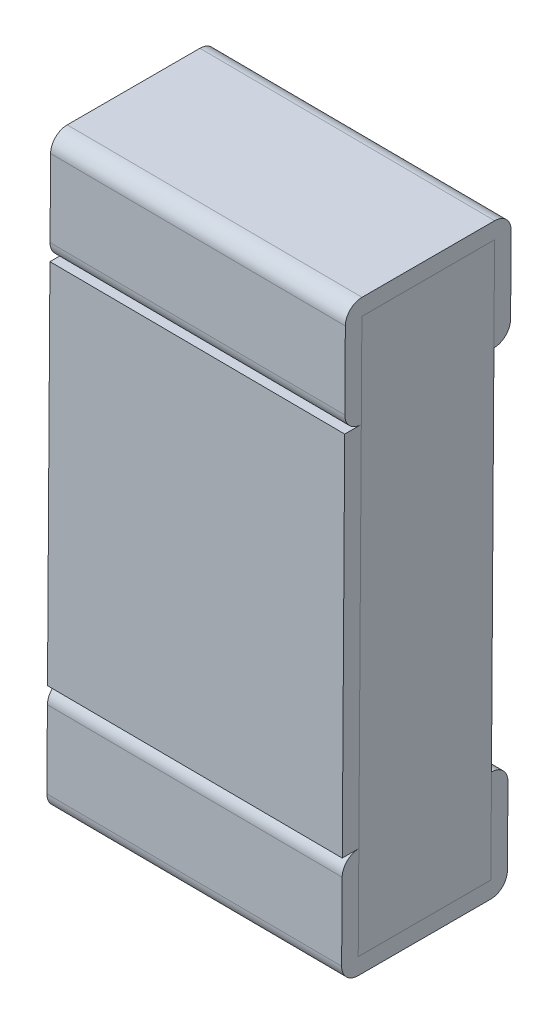
ISO-10303-21;
HEADER;
FILE_DESCRIPTION(('STEP AP214'),'2;1');
FILE_NAME('part.step','',(''),(''),'','','');
FILE_SCHEMA(('AUTOMOTIVE_DESIGN { 1 0 10303 214 1 1 1 1 }'));
ENDSEC;
DATA;
#1=APPLICATION_CONTEXT('core data for automotive mechanical design processes');
#2=APPLICATION_PROTOCOL_DEFINITION('international standard','automotive_design',2000,#1);
#3=PRODUCT_CONTEXT('',#1,'mechanical');
#4=PRODUCT('Part','Part','',(#3));
#5=PRODUCT_RELATED_PRODUCT_CATEGORY('part','',(#4));
#6=PRODUCT_DEFINITION_FORMATION('','',#4);
#7=PRODUCT_DEFINITION_CONTEXT('part definition',#1,'design');
#8=PRODUCT_DEFINITION('design','',#6,#7);
#9=PRODUCT_DEFINITION_SHAPE('','',#8);
#10=(LENGTH_UNIT() NAMED_UNIT(*) SI_UNIT(.MILLI.,.METRE.));
#11=(NAMED_UNIT(*) PLANE_ANGLE_UNIT() SI_UNIT($,.RADIAN.));
#12=(NAMED_UNIT(*) SI_UNIT($,.STERADIAN.) SOLID_ANGLE_UNIT());
#13=UNCERTAINTY_MEASURE_WITH_UNIT(LENGTH_MEASURE(1.E-05),#10,'distance_accuracy_value','');
#14=(GEOMETRIC_REPRESENTATION_CONTEXT(3) GLOBAL_UNCERTAINTY_ASSIGNED_CONTEXT((#13)) GLOBAL_UNIT_ASSIGNED_CONTEXT((#10,
#11,#12)) REPRESENTATION_CONTEXT('',''));
#15=CARTESIAN_POINT('',(0.,0.,0.));
#16=DIRECTION('',(0.,0.,1.));
#17=DIRECTION('',(1.,0.,0.));
#18=AXIS2_PLACEMENT_3D('',#15,#16,#17);
#19=CARTESIAN_POINT('',(187.546385875029,105.575053964965,142.661582908599));
#20=DIRECTION('',(0.,0.,1.));
#21=DIRECTION('',(1.,0.,0.));
#22=AXIS2_PLACEMENT_3D('',#19,#20,#21);
#23=PLANE('',#22);
#24=DIRECTION('',(-0.999978016708569,0.00663069374923689,0.));
#25=VECTOR('',#24,1.);
#26=CARTESIAN_POINT('',(187.546385875029,105.575053964965,142.661582908599));
#27=LINE('',#26,#25);
#28=CARTESIAN_POINT('',(187.546385875029,105.575053964965,142.661582908599));
#29=VERTEX_POINT('',#28);
#30=CARTESIAN_POINT('',(186.746403461662,105.580358519964,142.661582908599));
#31=VERTEX_POINT('',#30);
#32=EDGE_CURVE('E66',#29,#31,#27,.T.);
#33=ORIENTED_EDGE('',*,*,#32,.F.);
#34=DIRECTION('',(0.00663069374923689,0.999978016708569,0.));
#35=VECTOR('',#34,1.);
#36=CARTESIAN_POINT('',(187.546385875029,105.575053964965,142.661582908599));
#37=LINE('',#36,#35);
#38=CARTESIAN_POINT('',(187.553016568778,106.575031981673,142.661582908599));
#39=VERTEX_POINT('',#38);
#40=EDGE_CURVE('E11',#29,#39,#37,.T.);
#41=ORIENTED_EDGE('',*,*,#40,.T.);
#42=DIRECTION('',(-0.999978016708569,0.00663069374923689,0.));
#43=VECTOR('',#42,1.);
#44=CARTESIAN_POINT('',(187.553016568778,106.575031981673,142.661582908599));
#45=LINE('',#44,#43);
#46=CARTESIAN_POINT('',(186.753034155411,106.580336536673,142.661582908599));
#47=VERTEX_POINT('',#46);
#48=EDGE_CURVE('E48',#39,#47,#45,.T.);
#49=ORIENTED_EDGE('',*,*,#48,.T.);
#50=DIRECTION('',(0.00663069374923689,0.999978016708569,0.));
#51=VECTOR('',#50,1.);
#52=CARTESIAN_POINT('',(186.746403461662,105.580358519964,142.661582908599));
#53=LINE('',#52,#51);
#54=EDGE_CURVE('E253',#31,#47,#53,.T.);
#55=ORIENTED_EDGE('',*,*,#54,.F.);
#56=EDGE_LOOP('',(#33,#41,#49,#55));
#57=FACE_BOUND('',#56,.T.);
#58=ADVANCED_FACE('F44',(#57),#23,.T.);
#59=CARTESIAN_POINT('',(187.553016568778,106.575031981673,142.616582908599));
#60=DIRECTION('',(0.00663069374923689,0.99997801670857,0.));
#61=DIRECTION('',(0.,0.,-1.));
#62=AXIS2_PLACEMENT_3D('',#59,#60,#61);
#63=PLANE('',#62);
#64=DIRECTION('',(0.,0.,1.));
#65=VECTOR('',#64,1.);
#66=CARTESIAN_POINT('',(187.553016568778,106.575031981673,142.616582908599));
#67=LINE('',#66,#65);
#68=CARTESIAN_POINT('',(187.553016568778,106.575031981673,142.616582908599));
#69=VERTEX_POINT('',#68);
#70=EDGE_CURVE('E263',#69,#39,#67,.T.);
#71=ORIENTED_EDGE('',*,*,#70,.F.);
#72=DIRECTION('',(-0.999978016708569,0.00663069374923689,0.));
#73=VECTOR('',#72,1.);
#74=CARTESIAN_POINT('',(187.553016568778,106.575031981673,142.616582908599));
#75=LINE('',#74,#73);
#76=CARTESIAN_POINT('',(186.753034155411,106.580336536673,142.616582908599));
#77=VERTEX_POINT('',#76);
#78=EDGE_CURVE('E380',#69,#77,#75,.T.);
#79=ORIENTED_EDGE('',*,*,#78,.T.);
#80=DIRECTION('',(0.,0.,1.));
#81=VECTOR('',#80,1.);
#82=CARTESIAN_POINT('',(186.753034155411,106.580336536673,142.616582908599));
#83=LINE('',#82,#81);
#84=EDGE_CURVE('E361',#77,#47,#83,.T.);
#85=ORIENTED_EDGE('',*,*,#84,.T.);
#86=ORIENTED_EDGE('',*,*,#48,.F.);
#87=EDGE_LOOP('',(#71,#79,#85,#86));
#88=FACE_BOUND('',#87,.T.);
#89=ADVANCED_FACE('F482',(#88),#63,.T.);
#90=CARTESIAN_POINT('',(187.553314949996,106.620030992425,142.616582908599));
#91=DIRECTION('',(-0.999978016708571,0.00663069374900344,0.));
#92=DIRECTION('',(-0.00663069374900344,-0.999978016708571,0.));
#93=AXIS2_PLACEMENT_3D('',#90,#91,#92);
#94=CYLINDRICAL_SURFACE('',#93,0.0450000000000037);
#95=CARTESIAN_POINT('',(187.553314949996,106.620030992425,142.616582908599));
#96=DIRECTION('',(-0.99997801670857,0.00663069374923689,0.));
#97=DIRECTION('',(0.,0.,1.));
#98=AXIS2_PLACEMENT_3D('',#95,#96,#97);
#99=CIRCLE('',#98,0.0449999999999895);
#100=CARTESIAN_POINT('',(187.553314949996,106.620030992425,142.661582908599));
#101=VERTEX_POINT('',#100);
#102=EDGE_CURVE('E357',#69,#101,#99,.T.);
#103=ORIENTED_EDGE('',*,*,#102,.T.);
#104=DIRECTION('',(-0.999978016708569,0.00663069374923689,0.));
#105=VECTOR('',#104,1.);
#106=CARTESIAN_POINT('',(187.553314949996,106.620030992425,142.661582908599));
#107=LINE('',#106,#105);
#108=CARTESIAN_POINT('',(186.75333253663,106.625335547425,142.661582908599));
#109=VERTEX_POINT('',#108);
#110=EDGE_CURVE('E362',#101,#109,#107,.T.);
#111=ORIENTED_EDGE('',*,*,#110,.T.);
#112=CARTESIAN_POINT('',(186.75333253663,106.625335547425,142.616582908599));
#113=DIRECTION('',(-0.99997801670857,0.00663069374923689,0.));
#114=DIRECTION('',(0.,0.,1.));
#115=AXIS2_PLACEMENT_3D('',#112,#113,#114);
#116=CIRCLE('',#115,0.0449999999999895);
#117=EDGE_CURVE('E257',#77,#109,#116,.T.);
#118=ORIENTED_EDGE('',*,*,#117,.F.);
#119=ORIENTED_EDGE('',*,*,#78,.F.);
#120=EDGE_LOOP('',(#103,#111,#118,#119));
#121=FACE_BOUND('',#120,.T.);
#122=ADVANCED_FACE('F565',(#121),#94,.T.);
#123=CARTESIAN_POINT('',(187.553016568778,106.575031981673,142.661582908599));
#124=DIRECTION('',(0.,0.,1.));
#125=DIRECTION('',(1.,0.,0.));
#126=AXIS2_PLACEMENT_3D('',#123,#124,#125);
#127=PLANE('',#126);
#128=DIRECTION('',(0.00663069374923689,0.999978016708569,0.));
#129=VECTOR('',#128,1.);
#130=CARTESIAN_POINT('',(186.753034155411,106.580336536673,142.661582908599));
#131=LINE('',#130,#129);
#132=CARTESIAN_POINT('',(186.754724982317,106.835330930934,142.661582908599));
#133=VERTEX_POINT('',#132);
#134=EDGE_CURVE('E308',#109,#133,#131,.T.);
#135=ORIENTED_EDGE('',*,*,#134,.F.);
#136=ORIENTED_EDGE('',*,*,#110,.F.);
#137=DIRECTION('',(0.00663069374923689,0.999978016708569,0.));
#138=VECTOR('',#137,1.);
#139=CARTESIAN_POINT('',(187.553016568778,106.575031981673,142.661582908599));
#140=LINE('',#139,#138);
#141=CARTESIAN_POINT('',(187.554707395684,106.830026375934,142.661582908599));
#142=VERTEX_POINT('',#141);
#143=EDGE_CURVE('E414',#101,#142,#140,.T.);
#144=ORIENTED_EDGE('',*,*,#143,.T.);
#145=DIRECTION('',(-0.999978016708569,0.00663069374923689,0.));
#146=VECTOR('',#145,1.);
#147=CARTESIAN_POINT('',(187.554707395684,106.830026375934,142.661582908599));
#148=LINE('',#147,#146);
#149=EDGE_CURVE('E315',#142,#133,#148,.T.);
#150=ORIENTED_EDGE('',*,*,#149,.T.);
#151=EDGE_LOOP('',(#135,#136,#144,#150));
#152=FACE_BOUND('',#151,.T.);
#153=ADVANCED_FACE('F584',(#152),#127,.T.);
#154=CARTESIAN_POINT('',(187.554707395684,106.830026375934,142.616582908599));
#155=DIRECTION('',(-0.999978016708571,0.00663069374900344,0.));
#156=DIRECTION('',(0.00663069374900344,0.999978016708571,0.));
#157=AXIS2_PLACEMENT_3D('',#154,#155,#156);
#158=CYLINDRICAL_SURFACE('',#157,0.0450000000000037);
#159=DIRECTION('',(-0.999978016708569,0.00663069374923689,0.));
#160=VECTOR('',#159,1.);
#161=CARTESIAN_POINT('',(187.555005776903,106.875025386686,142.616582908599));
#162=LINE('',#161,#160);
#163=CARTESIAN_POINT('',(187.555005776903,106.875025386686,142.616582908599));
#164=VERTEX_POINT('',#163);
#165=CARTESIAN_POINT('',(186.755023363535,106.880329941685,142.616582908599));
#166=VERTEX_POINT('',#165);
#167=EDGE_CURVE('E311',#164,#166,#162,.T.);
#168=ORIENTED_EDGE('',*,*,#167,.T.);
#169=CARTESIAN_POINT('',(186.754724982317,106.835330930934,142.616582908599));
#170=DIRECTION('',(0.99997801670857,-0.00663069374923689,0.));
#171=DIRECTION('',(0.,0.,1.));
#172=AXIS2_PLACEMENT_3D('',#169,#170,#171);
#173=CIRCLE('',#172,0.0449999999999895);
#174=EDGE_CURVE('E316',#166,#133,#173,.T.);
#175=ORIENTED_EDGE('',*,*,#174,.T.);
#176=ORIENTED_EDGE('',*,*,#149,.F.);
#177=CARTESIAN_POINT('',(187.554707395684,106.830026375934,142.616582908599));
#178=DIRECTION('',(0.99997801670857,-0.00663069374923689,0.));
#179=DIRECTION('',(0.,0.,1.));
#180=AXIS2_PLACEMENT_3D('',#177,#178,#179);
#181=CIRCLE('',#180,0.0449999999999895);
#182=EDGE_CURVE('E345',#164,#142,#181,.T.);
#183=ORIENTED_EDGE('',*,*,#182,.F.);
#184=EDGE_LOOP('',(#168,#175,#176,#183));
#185=FACE_BOUND('',#184,.T.);
#186=ADVANCED_FACE('F580',(#185),#158,.T.);
#187=CARTESIAN_POINT('',(187.555005776903,106.875025386686,142.211582908599));
#188=DIRECTION('',(0.00663069374923689,0.99997801670857,0.));
#189=DIRECTION('',(0.,0.,-1.));
#190=AXIS2_PLACEMENT_3D('',#187,#188,#189);
#191=PLANE('',#190);
#192=DIRECTION('',(0.,0.,1.));
#193=VECTOR('',#192,1.);
#194=CARTESIAN_POINT('',(187.555005776903,106.875025386686,142.211582908599));
#195=LINE('',#194,#193);
#196=CARTESIAN_POINT('',(187.555005776903,106.875025386686,142.256582908599));
#197=VERTEX_POINT('',#196);
#198=EDGE_CURVE('E384',#197,#164,#195,.T.);
#199=ORIENTED_EDGE('',*,*,#198,.F.);
#200=DIRECTION('',(-0.999978016708569,0.00663069374923689,0.));
#201=VECTOR('',#200,1.);
#202=CARTESIAN_POINT('',(187.555005776903,106.875025386686,142.256582908599));
#203=LINE('',#202,#201);
#204=CARTESIAN_POINT('',(186.755023363535,106.880329941685,142.256582908599));
#205=VERTEX_POINT('',#204);
#206=EDGE_CURVE('E299',#197,#205,#203,.T.);
#207=ORIENTED_EDGE('',*,*,#206,.T.);
#208=DIRECTION('',(0.,0.,1.));
#209=VECTOR('',#208,1.);
#210=CARTESIAN_POINT('',(186.755023363535,106.880329941685,142.211582908599));
#211=LINE('',#210,#209);
#212=EDGE_CURVE('E295',#205,#166,#211,.T.);
#213=ORIENTED_EDGE('',*,*,#212,.T.);
#214=ORIENTED_EDGE('',*,*,#167,.F.);
#215=EDGE_LOOP('',(#199,#207,#213,#214));
#216=FACE_BOUND('',#215,.T.);
#217=ADVANCED_FACE('F583',(#216),#191,.T.);
#218=CARTESIAN_POINT('',(187.554707395684,106.830026375934,142.256582908599));
#219=DIRECTION('',(-0.999978016708571,0.00663069374900344,0.));
#220=DIRECTION('',(0.00663069374900344,0.999978016708571,0.));
#221=AXIS2_PLACEMENT_3D('',#218,#219,#220);
#222=CYLINDRICAL_SURFACE('',#221,0.0450000000000037);
#223=CARTESIAN_POINT('',(187.554707395684,106.830026375934,142.256582908599));
#224=DIRECTION('',(-0.99997801670857,0.00663069374923689,0.));
#225=DIRECTION('',(0.,0.,1.));
#226=AXIS2_PLACEMENT_3D('',#223,#224,#225);
#227=CIRCLE('',#226,0.0449999999999895);
#228=CARTESIAN_POINT('',(187.554707395684,106.830026375934,142.211582908599));
#229=VERTEX_POINT('',#228);
#230=EDGE_CURVE('E300',#197,#229,#227,.T.);
#231=ORIENTED_EDGE('',*,*,#230,.T.);
#232=DIRECTION('',(-0.999978016708569,0.00663069374923689,0.));
#233=VECTOR('',#232,1.);
#234=CARTESIAN_POINT('',(187.554707395684,106.830026375934,142.211582908599));
#235=LINE('',#234,#233);
#236=CARTESIAN_POINT('',(186.754724982317,106.835330930934,142.211582908599));
#237=VERTEX_POINT('',#236);
#238=EDGE_CURVE('E238',#229,#237,#235,.T.);
#239=ORIENTED_EDGE('',*,*,#238,.T.);
#240=CARTESIAN_POINT('',(186.754724982317,106.835330930934,142.256582908599));
#241=DIRECTION('',(-0.99997801670857,0.00663069374923689,0.));
#242=DIRECTION('',(0.,0.,1.));
#243=AXIS2_PLACEMENT_3D('',#240,#241,#242);
#244=CIRCLE('',#243,0.0449999999999895);
#245=EDGE_CURVE('E223',#205,#237,#244,.T.);
#246=ORIENTED_EDGE('',*,*,#245,.F.);
#247=ORIENTED_EDGE('',*,*,#206,.F.);
#248=EDGE_LOOP('',(#231,#239,#246,#247));
#249=FACE_BOUND('',#248,.T.);
#250=ADVANCED_FACE('F586',(#249),#222,.T.);
#251=CARTESIAN_POINT('',(187.553016568778,106.575031981673,142.211582908599));
#252=DIRECTION('',(0.,0.,1.));
#253=DIRECTION('',(1.,0.,0.));
#254=AXIS2_PLACEMENT_3D('',#251,#252,#253);
#255=PLANE('',#254);
#256=ORIENTED_EDGE('',*,*,#238,.F.);
#257=DIRECTION('',(0.00663069374923689,0.999978016708569,0.));
#258=VECTOR('',#257,1.);
#259=CARTESIAN_POINT('',(187.553016568778,106.575031981673,142.211582908599));
#260=LINE('',#259,#258);
#261=CARTESIAN_POINT('',(187.553314949996,106.620030992425,142.211582908599));
#262=VERTEX_POINT('',#261);
#263=EDGE_CURVE('E233',#262,#229,#260,.T.);
#264=ORIENTED_EDGE('',*,*,#263,.F.);
#265=DIRECTION('',(-0.999978016708569,0.00663069374923689,0.));
#266=VECTOR('',#265,1.);
#267=CARTESIAN_POINT('',(187.553314949996,106.620030992425,142.211582908599));
#268=LINE('',#267,#266);
#269=CARTESIAN_POINT('',(186.75333253663,106.625335547425,142.211582908599));
#270=VERTEX_POINT('',#269);
#271=EDGE_CURVE('E227',#262,#270,#268,.T.);
#272=ORIENTED_EDGE('',*,*,#271,.T.);
#273=DIRECTION('',(0.00663069374923689,0.999978016708569,0.));
#274=VECTOR('',#273,1.);
#275=CARTESIAN_POINT('',(186.753034155411,106.580336536673,142.211582908599));
#276=LINE('',#275,#274);
#277=EDGE_CURVE('E216',#270,#237,#276,.T.);
#278=ORIENTED_EDGE('',*,*,#277,.T.);
#279=EDGE_LOOP('',(#256,#264,#272,#278));
#280=FACE_BOUND('',#279,.T.);
#281=ADVANCED_FACE('F231',(#280),#255,.F.);
#282=CARTESIAN_POINT('',(187.553314949996,106.620030992425,142.256582908599));
#283=DIRECTION('',(-0.999978016708571,0.00663069374900344,0.));
#284=DIRECTION('',(-0.00663069374900344,-0.999978016708571,0.));
#285=AXIS2_PLACEMENT_3D('',#282,#283,#284);
#286=CYLINDRICAL_SURFACE('',#285,0.0450000000000037);
#287=DIRECTION('',(-0.999978016708569,0.00663069374923689,0.));
#288=VECTOR('',#287,1.);
#289=CARTESIAN_POINT('',(187.553016568778,106.575031981673,142.256582908599));
#290=LINE('',#289,#288);
#291=CARTESIAN_POINT('',(187.553016568778,106.575031981673,142.256582908599));
#292=VERTEX_POINT('',#291);
#293=CARTESIAN_POINT('',(186.753034155411,106.580336536673,142.256582908599));
#294=VERTEX_POINT('',#293);
#295=EDGE_CURVE('E228',#292,#294,#290,.T.);
#296=ORIENTED_EDGE('',*,*,#295,.T.);
#297=CARTESIAN_POINT('',(186.75333253663,106.625335547425,142.256582908599));
#298=DIRECTION('',(0.99997801670857,-0.00663069374923689,0.));
#299=DIRECTION('',(0.,0.,1.));
#300=AXIS2_PLACEMENT_3D('',#297,#298,#299);
#301=CIRCLE('',#300,0.0449999999999895);
#302=EDGE_CURVE('E220',#294,#270,#301,.T.);
#303=ORIENTED_EDGE('',*,*,#302,.T.);
#304=ORIENTED_EDGE('',*,*,#271,.F.);
#305=CARTESIAN_POINT('',(187.553314949996,106.620030992425,142.256582908599));
#306=DIRECTION('',(0.99997801670857,-0.00663069374923689,0.));
#307=DIRECTION('',(0.,0.,1.));
#308=AXIS2_PLACEMENT_3D('',#305,#306,#307);
#309=CIRCLE('',#308,0.0449999999999895);
#310=EDGE_CURVE('E346',#292,#262,#309,.T.);
#311=ORIENTED_EDGE('',*,*,#310,.F.);
#312=EDGE_LOOP('',(#296,#303,#304,#311));
#313=FACE_BOUND('',#312,.T.);
#314=ADVANCED_FACE('F240',(#313),#286,.T.);
#315=CARTESIAN_POINT('',(186.746403461662,105.580358519964,142.616582908599));
#316=DIRECTION('',(-0.99997801670857,0.00663069374923689,0.));
#317=DIRECTION('',(0.,0.,1.));
#318=AXIS2_PLACEMENT_3D('',#315,#316,#317);
#319=PLANE('',#318);
#320=DIRECTION('',(0.00663069374923689,0.999978016708569,0.));
#321=VECTOR('',#320,1.);
#322=CARTESIAN_POINT('',(186.746403461662,105.580358519964,142.616582908599));
#323=LINE('',#322,#321);
#324=CARTESIAN_POINT('',(186.746403461662,105.580358519964,142.616582908599));
#325=VERTEX_POINT('',#324);
#326=EDGE_CURVE('E388',#325,#77,#323,.T.);
#327=ORIENTED_EDGE('',*,*,#326,.F.);
#328=DIRECTION('',(0.,0.,1.));
#329=VECTOR('',#328,1.);
#330=CARTESIAN_POINT('',(186.746403461662,105.580358519964,142.616582908599));
#331=LINE('',#330,#329);
#332=EDGE_CURVE('E244',#325,#31,#331,.T.);
#333=ORIENTED_EDGE('',*,*,#332,.T.);
#334=ORIENTED_EDGE('',*,*,#54,.T.);
#335=ORIENTED_EDGE('',*,*,#84,.F.);
#336=EDGE_LOOP('',(#327,#333,#334,#335));
#337=FACE_BOUND('',#336,.T.);
#338=ADVANCED_FACE('F485',(#337),#319,.T.);
#339=CARTESIAN_POINT('',(186.753034155411,106.580336536673,142.211582908599));
#340=DIRECTION('',(-0.99997801670857,0.00663069374923689,0.));
#341=DIRECTION('',(0.,0.,1.));
#342=AXIS2_PLACEMENT_3D('',#339,#340,#341);
#343=PLANE('',#342);
#344=ORIENTED_EDGE('',*,*,#277,.F.);
#345=ORIENTED_EDGE('',*,*,#302,.F.);
#346=DIRECTION('',(0.00663069374923689,0.999978016708569,0.));
#347=VECTOR('',#346,1.);
#348=CARTESIAN_POINT('',(186.744712634756,105.325364125704,142.256582908599));
#349=LINE('',#348,#347);
#350=CARTESIAN_POINT('',(186.754724982317,106.835330930934,142.256582908599));
#351=VERTEX_POINT('',#350);
#352=EDGE_CURVE('E363',#294,#351,#349,.T.);
#353=ORIENTED_EDGE('',*,*,#352,.T.);
#354=DIRECTION('',(0.,0.,1.));
#355=VECTOR('',#354,1.);
#356=CARTESIAN_POINT('',(186.754724982317,106.835330930934,142.256582908599));
#357=LINE('',#356,#355);
#358=CARTESIAN_POINT('',(186.754724982317,106.835330930934,142.616582908599));
#359=VERTEX_POINT('',#358);
#360=EDGE_CURVE('E366',#351,#359,#357,.T.);
#361=ORIENTED_EDGE('',*,*,#360,.T.);
#362=DIRECTION('',(0.00663069374923689,0.999978016708569,0.));
#363=VECTOR('',#362,1.);
#364=CARTESIAN_POINT('',(186.744712634756,105.325364125704,142.616582908599));
#365=LINE('',#364,#363);
#366=EDGE_CURVE('E294',#77,#359,#365,.T.);
#367=ORIENTED_EDGE('',*,*,#366,.F.);
#368=ORIENTED_EDGE('',*,*,#117,.T.);
#369=ORIENTED_EDGE('',*,*,#134,.T.);
#370=ORIENTED_EDGE('',*,*,#174,.F.);
#371=ORIENTED_EDGE('',*,*,#212,.F.);
#372=ORIENTED_EDGE('',*,*,#245,.T.);
#373=EDGE_LOOP('',(#344,#345,#353,#361,#367,#368,#369,#370,#371,#372));
#374=FACE_BOUND('',#373,.T.);
#375=ADVANCED_FACE('F218',(#374),#343,.T.);
#376=CARTESIAN_POINT('',(187.546385875029,105.575053964965,142.616582908599));
#377=DIRECTION('',(0.00663069374923689,0.99997801670857,0.));
#378=DIRECTION('',(0.,0.,-1.));
#379=AXIS2_PLACEMENT_3D('',#376,#377,#378);
#380=PLANE('',#379);
#381=ORIENTED_EDGE('',*,*,#32,.T.);
#382=ORIENTED_EDGE('',*,*,#332,.F.);
#383=DIRECTION('',(-0.999978016708569,0.00663069374923689,0.));
#384=VECTOR('',#383,1.);
#385=CARTESIAN_POINT('',(187.546385875029,105.575053964965,142.616582908599));
#386=LINE('',#385,#384);
#387=CARTESIAN_POINT('',(187.546385875029,105.575053964965,142.616582908599));
#388=VERTEX_POINT('',#387);
#389=EDGE_CURVE('E291',#388,#325,#386,.T.);
#390=ORIENTED_EDGE('',*,*,#389,.F.);
#391=DIRECTION('',(0.,0.,1.));
#392=VECTOR('',#391,1.);
#393=CARTESIAN_POINT('',(187.546385875029,105.575053964965,142.616582908599));
#394=LINE('',#393,#392);
#395=EDGE_CURVE('E266',#388,#29,#394,.T.);
#396=ORIENTED_EDGE('',*,*,#395,.T.);
#397=EDGE_LOOP('',(#381,#382,#390,#396));
#398=FACE_BOUND('',#397,.T.);
#399=ADVANCED_FACE('F490',(#398),#380,.F.);
#400=CARTESIAN_POINT('',(187.546385875029,105.575053964965,142.616582908599));
#401=DIRECTION('',(-0.99997801670857,0.00663069374923689,0.));
#402=DIRECTION('',(0.,0.,1.));
#403=AXIS2_PLACEMENT_3D('',#400,#401,#402);
#404=PLANE('',#403);
#405=ORIENTED_EDGE('',*,*,#70,.T.);
#406=ORIENTED_EDGE('',*,*,#40,.F.);
#407=ORIENTED_EDGE('',*,*,#395,.F.);
#408=DIRECTION('',(0.00663069374923689,0.999978016708569,0.));
#409=VECTOR('',#408,1.);
#410=CARTESIAN_POINT('',(187.546385875029,105.575053964965,142.616582908599));
#411=LINE('',#410,#409);
#412=EDGE_CURVE('E267',#388,#69,#411,.T.);
#413=ORIENTED_EDGE('',*,*,#412,.T.);
#414=EDGE_LOOP('',(#405,#406,#407,#413));
#415=FACE_BOUND('',#414,.T.);
#416=ADVANCED_FACE('F575',(#415),#404,.F.);
#417=CARTESIAN_POINT('',(187.553016568778,106.575031981673,142.211582908599));
#418=DIRECTION('',(-0.99997801670857,0.00663069374923689,0.));
#419=DIRECTION('',(0.,0.,1.));
#420=AXIS2_PLACEMENT_3D('',#417,#418,#419);
#421=PLANE('',#420);
#422=ORIENTED_EDGE('',*,*,#230,.F.);
#423=ORIENTED_EDGE('',*,*,#198,.T.);
#424=ORIENTED_EDGE('',*,*,#182,.T.);
#425=ORIENTED_EDGE('',*,*,#143,.F.);
#426=ORIENTED_EDGE('',*,*,#102,.F.);
#427=DIRECTION('',(0.00663069374923689,0.999978016708569,0.));
#428=VECTOR('',#427,1.);
#429=CARTESIAN_POINT('',(187.544695048123,105.320059570704,142.616582908599));
#430=LINE('',#429,#428);
#431=CARTESIAN_POINT('',(187.554707395684,106.830026375934,142.616582908599));
#432=VERTEX_POINT('',#431);
#433=EDGE_CURVE('E342',#69,#432,#430,.T.);
#434=ORIENTED_EDGE('',*,*,#433,.T.);
#435=DIRECTION('',(0.,0.,1.));
#436=VECTOR('',#435,1.);
#437=CARTESIAN_POINT('',(187.554707395684,106.830026375934,142.256582908599));
#438=LINE('',#437,#436);
#439=CARTESIAN_POINT('',(187.554707395684,106.830026375934,142.256582908599));
#440=VERTEX_POINT('',#439);
#441=EDGE_CURVE('E391',#440,#432,#438,.T.);
#442=ORIENTED_EDGE('',*,*,#441,.F.);
#443=DIRECTION('',(0.00663069374923689,0.999978016708569,0.));
#444=VECTOR('',#443,1.);
#445=CARTESIAN_POINT('',(187.544695048123,105.320059570704,142.256582908599));
#446=LINE('',#445,#444);
#447=EDGE_CURVE('E395',#292,#440,#446,.T.);
#448=ORIENTED_EDGE('',*,*,#447,.F.);
#449=ORIENTED_EDGE('',*,*,#310,.T.);
#450=ORIENTED_EDGE('',*,*,#263,.T.);
#451=EDGE_LOOP('',(#422,#423,#424,#425,#426,#434,#442,#448,#449,#450));
#452=FACE_BOUND('',#451,.T.);
#453=ADVANCED_FACE('F578',(#452),#421,.F.);
#454=CARTESIAN_POINT('',(187.544695048123,105.320059570704,142.256582908599));
#455=DIRECTION('',(0.,0.,1.));
#456=DIRECTION('',(1.,0.,0.));
#457=AXIS2_PLACEMENT_3D('',#454,#455,#456);
#458=PLANE('',#457);
#459=DIRECTION('',(0.00663069374923689,0.999978016708569,0.));
#460=VECTOR('',#459,1.);
#461=CARTESIAN_POINT('',(186.744712634756,105.325364125704,142.256582908599));
#462=LINE('',#461,#460);
#463=CARTESIAN_POINT('',(186.746403461662,105.580358519964,142.256582908599));
#464=VERTEX_POINT('',#463);
#465=EDGE_CURVE('E383',#464,#294,#462,.T.);
#466=ORIENTED_EDGE('',*,*,#465,.T.);
#467=ORIENTED_EDGE('',*,*,#295,.F.);
#468=DIRECTION('',(0.00663069374923689,0.999978016708569,0.));
#469=VECTOR('',#468,1.);
#470=CARTESIAN_POINT('',(187.544695048123,105.320059570704,142.256582908599));
#471=LINE('',#470,#469);
#472=CARTESIAN_POINT('',(187.546385875029,105.575053964965,142.256582908599));
#473=VERTEX_POINT('',#472);
#474=EDGE_CURVE('E336',#473,#292,#471,.T.);
#475=ORIENTED_EDGE('',*,*,#474,.F.);
#476=DIRECTION('',(-0.999978016708569,0.00663069374923689,0.));
#477=VECTOR('',#476,1.);
#478=CARTESIAN_POINT('',(187.546385875029,105.575053964965,142.256582908599));
#479=LINE('',#478,#477);
#480=EDGE_CURVE('E272',#473,#464,#479,.T.);
#481=ORIENTED_EDGE('',*,*,#480,.T.);
#482=EDGE_LOOP('',(#466,#467,#475,#481));
#483=FACE_BOUND('',#482,.T.);
#484=ADVANCED_FACE('F607',(#483),#458,.F.);
#485=CARTESIAN_POINT('',(186.744712634756,105.325364125704,142.256582908599));
#486=DIRECTION('',(-0.99997801670857,0.00663069374923689,0.));
#487=DIRECTION('',(0.,0.,1.));
#488=AXIS2_PLACEMENT_3D('',#485,#486,#487);
#489=PLANE('',#488);
#490=DIRECTION('',(0.00663069374923689,0.999978016708569,0.));
#491=VECTOR('',#490,1.);
#492=CARTESIAN_POINT('',(186.744712634756,105.325364125704,142.256582908599));
#493=LINE('',#492,#491);
#494=CARTESIAN_POINT('',(186.744712634756,105.325364125704,142.256582908599));
#495=VERTEX_POINT('',#494);
#496=EDGE_CURVE('E340',#495,#464,#493,.T.);
#497=ORIENTED_EDGE('',*,*,#496,.F.);
#498=DIRECTION('',(0.,0.,1.));
#499=VECTOR('',#498,1.);
#500=CARTESIAN_POINT('',(186.744712634756,105.325364125704,142.256582908599));
#501=LINE('',#500,#499);
#502=CARTESIAN_POINT('',(186.744712634756,105.325364125704,142.616582908599));
#503=VERTEX_POINT('',#502);
#504=EDGE_CURVE('E269',#495,#503,#501,.T.);
#505=ORIENTED_EDGE('',*,*,#504,.T.);
#506=DIRECTION('',(0.00663069374923689,0.999978016708569,0.));
#507=VECTOR('',#506,1.);
#508=CARTESIAN_POINT('',(186.744712634756,105.325364125704,142.616582908599));
#509=LINE('',#508,#507);
#510=EDGE_CURVE('E273',#503,#325,#509,.T.);
#511=ORIENTED_EDGE('',*,*,#510,.T.);
#512=ORIENTED_EDGE('',*,*,#326,.T.);
#513=ORIENTED_EDGE('',*,*,#366,.T.);
#514=ORIENTED_EDGE('',*,*,#360,.F.);
#515=ORIENTED_EDGE('',*,*,#352,.F.);
#516=ORIENTED_EDGE('',*,*,#465,.F.);
#517=EDGE_LOOP('',(#497,#505,#511,#512,#513,#514,#515,#516));
#518=FACE_BOUND('',#517,.T.);
#519=ADVANCED_FACE('F556',(#518),#489,.T.);
#520=CARTESIAN_POINT('',(187.54608749381,105.530054954213,142.616582908599));
#521=DIRECTION('',(-0.999978016708571,0.00663069374900344,0.));
#522=DIRECTION('',(0.00663069374900344,0.999978016708571,0.));
#523=AXIS2_PLACEMENT_3D('',#520,#521,#522);
#524=CYLINDRICAL_SURFACE('',#523,0.0450000000000037);
#525=ORIENTED_EDGE('',*,*,#389,.T.);
#526=CARTESIAN_POINT('',(186.746105080443,105.535359509212,142.616582908599));
#527=DIRECTION('',(0.99997801670857,-0.00663069374923689,0.));
#528=DIRECTION('',(0.,0.,1.));
#529=AXIS2_PLACEMENT_3D('',#526,#527,#528);
#530=CIRCLE('',#529,0.0449999999999895);
#531=CARTESIAN_POINT('',(186.746105080443,105.535359509212,142.661582908599));
#532=VERTEX_POINT('',#531);
#533=EDGE_CURVE('E284',#325,#532,#530,.T.);
#534=ORIENTED_EDGE('',*,*,#533,.T.);
#535=DIRECTION('',(-0.999978016708569,0.00663069374923689,0.));
#536=VECTOR('',#535,1.);
#537=CARTESIAN_POINT('',(187.54608749381,105.530054954213,142.661582908599));
#538=LINE('',#537,#536);
#539=CARTESIAN_POINT('',(187.54608749381,105.530054954213,142.661582908599));
#540=VERTEX_POINT('',#539);
#541=EDGE_CURVE('E285',#540,#532,#538,.T.);
#542=ORIENTED_EDGE('',*,*,#541,.F.);
#543=CARTESIAN_POINT('',(187.54608749381,105.530054954213,142.616582908599));
#544=DIRECTION('',(0.99997801670857,-0.00663069374923689,0.));
#545=DIRECTION('',(0.,0.,1.));
#546=AXIS2_PLACEMENT_3D('',#543,#544,#545);
#547=CIRCLE('',#546,0.0449999999999895);
#548=EDGE_CURVE('E258',#388,#540,#547,.T.);
#549=ORIENTED_EDGE('',*,*,#548,.F.);
#550=EDGE_LOOP('',(#525,#534,#542,#549));
#551=FACE_BOUND('',#550,.T.);
#552=ADVANCED_FACE('F498',(#551),#524,.T.);
#553=CARTESIAN_POINT('',(187.544396666904,105.275060559952,142.661582908599));
#554=DIRECTION('',(0.,0.,1.));
#555=DIRECTION('',(1.,0.,0.));
#556=AXIS2_PLACEMENT_3D('',#553,#554,#555);
#557=PLANE('',#556);
#558=DIRECTION('',(0.00663069374923689,0.999978016708569,0.));
#559=VECTOR('',#558,1.);
#560=CARTESIAN_POINT('',(186.744414253537,105.280365114952,142.661582908599));
#561=LINE('',#560,#559);
#562=CARTESIAN_POINT('',(186.744712634756,105.325364125704,142.661582908599));
#563=VERTEX_POINT('',#562);
#564=EDGE_CURVE('E352',#563,#532,#561,.T.);
#565=ORIENTED_EDGE('',*,*,#564,.F.);
#566=DIRECTION('',(-0.999978016708569,0.00663069374923689,0.));
#567=VECTOR('',#566,1.);
#568=CARTESIAN_POINT('',(187.544695048123,105.320059570704,142.661582908599));
#569=LINE('',#568,#567);
#570=CARTESIAN_POINT('',(187.544695048123,105.320059570704,142.661582908599));
#571=VERTEX_POINT('',#570);
#572=EDGE_CURVE('E356',#571,#563,#569,.T.);
#573=ORIENTED_EDGE('',*,*,#572,.F.);
#574=DIRECTION('',(0.00663069374923689,0.999978016708569,0.));
#575=VECTOR('',#574,1.);
#576=CARTESIAN_POINT('',(187.544396666904,105.275060559952,142.661582908599));
#577=LINE('',#576,#575);
#578=EDGE_CURVE('E280',#571,#540,#577,.T.);
#579=ORIENTED_EDGE('',*,*,#578,.T.);
#580=ORIENTED_EDGE('',*,*,#541,.T.);
#581=EDGE_LOOP('',(#565,#573,#579,#580));
#582=FACE_BOUND('',#581,.T.);
#583=ADVANCED_FACE('F546',(#582),#557,.T.);
#584=CARTESIAN_POINT('',(187.544695048123,105.320059570704,142.256582908599));
#585=DIRECTION('',(-0.99997801670857,0.00663069374923689,0.));
#586=DIRECTION('',(0.,0.,1.));
#587=AXIS2_PLACEMENT_3D('',#584,#585,#586);
#588=PLANE('',#587);
#589=ORIENTED_EDGE('',*,*,#474,.T.);
#590=ORIENTED_EDGE('',*,*,#447,.T.);
#591=ORIENTED_EDGE('',*,*,#441,.T.);
#592=ORIENTED_EDGE('',*,*,#433,.F.);
#593=ORIENTED_EDGE('',*,*,#412,.F.);
#594=DIRECTION('',(0.00663069374923689,0.999978016708569,0.));
#595=VECTOR('',#594,1.);
#596=CARTESIAN_POINT('',(187.544695048123,105.320059570704,142.616582908599));
#597=LINE('',#596,#595);
#598=CARTESIAN_POINT('',(187.544695048123,105.320059570704,142.616582908599));
#599=VERTEX_POINT('',#598);
#600=EDGE_CURVE('E260',#599,#388,#597,.T.);
#601=ORIENTED_EDGE('',*,*,#600,.F.);
#602=DIRECTION('',(0.,0.,1.));
#603=VECTOR('',#602,1.);
#604=CARTESIAN_POINT('',(187.544695048123,105.320059570704,142.256582908599));
#605=LINE('',#604,#603);
#606=CARTESIAN_POINT('',(187.544695048123,105.320059570704,142.256582908599));
#607=VERTEX_POINT('',#606);
#608=EDGE_CURVE('E329',#607,#599,#605,.T.);
#609=ORIENTED_EDGE('',*,*,#608,.F.);
#610=DIRECTION('',(0.00663069374923689,0.999978016708569,0.));
#611=VECTOR('',#610,1.);
#612=CARTESIAN_POINT('',(187.544695048123,105.320059570704,142.256582908599));
#613=LINE('',#612,#611);
#614=EDGE_CURVE('E278',#607,#473,#613,.T.);
#615=ORIENTED_EDGE('',*,*,#614,.T.);
#616=EDGE_LOOP('',(#589,#590,#591,#592,#593,#601,#609,#615));
#617=FACE_BOUND('',#616,.T.);
#618=ADVANCED_FACE('F548',(#617),#588,.F.);
#619=CARTESIAN_POINT('',(187.54608749381,105.530054954213,142.256582908599));
#620=DIRECTION('',(-0.999978016708571,0.00663069374900344,0.));
#621=DIRECTION('',(0.00663069374900344,0.999978016708571,0.));
#622=AXIS2_PLACEMENT_3D('',#619,#620,#621);
#623=CYLINDRICAL_SURFACE('',#622,0.0450000000000037);
#624=CARTESIAN_POINT('',(187.54608749381,105.530054954213,142.256582908599));
#625=DIRECTION('',(-0.99997801670857,0.00663069374923689,0.));
#626=DIRECTION('',(0.,0.,1.));
#627=AXIS2_PLACEMENT_3D('',#624,#625,#626);
#628=CIRCLE('',#627,0.0449999999999895);
#629=CARTESIAN_POINT('',(187.54608749381,105.530054954213,142.211582908599));
#630=VERTEX_POINT('',#629);
#631=EDGE_CURVE('E274',#473,#630,#628,.T.);
#632=ORIENTED_EDGE('',*,*,#631,.T.);
#633=DIRECTION('',(-0.999978016708569,0.00663069374923689,0.));
#634=VECTOR('',#633,1.);
#635=CARTESIAN_POINT('',(187.54608749381,105.530054954213,142.211582908599));
#636=LINE('',#635,#634);
#637=CARTESIAN_POINT('',(186.746105080443,105.535359509212,142.211582908599));
#638=VERTEX_POINT('',#637);
#639=EDGE_CURVE('E279',#630,#638,#636,.T.);
#640=ORIENTED_EDGE('',*,*,#639,.T.);
#641=CARTESIAN_POINT('',(186.746105080443,105.535359509212,142.256582908599));
#642=DIRECTION('',(-0.99997801670857,0.00663069374923689,0.));
#643=DIRECTION('',(0.,0.,1.));
#644=AXIS2_PLACEMENT_3D('',#641,#642,#643);
#645=CIRCLE('',#644,0.0449999999999895);
#646=EDGE_CURVE('E337',#464,#638,#645,.T.);
#647=ORIENTED_EDGE('',*,*,#646,.F.);
#648=ORIENTED_EDGE('',*,*,#480,.F.);
#649=EDGE_LOOP('',(#632,#640,#647,#648));
#650=FACE_BOUND('',#649,.T.);
#651=ADVANCED_FACE('F522',(#650),#623,.T.);
#652=CARTESIAN_POINT('',(187.544396666904,105.275060559952,142.211582908599));
#653=DIRECTION('',(0.,0.,1.));
#654=DIRECTION('',(1.,0.,0.));
#655=AXIS2_PLACEMENT_3D('',#652,#653,#654);
#656=PLANE('',#655);
#657=ORIENTED_EDGE('',*,*,#639,.F.);
#658=DIRECTION('',(0.00663069374923689,0.999978016708569,0.));
#659=VECTOR('',#658,1.);
#660=CARTESIAN_POINT('',(187.544396666904,105.275060559952,142.211582908599));
#661=LINE('',#660,#659);
#662=CARTESIAN_POINT('',(187.544695048123,105.320059570704,142.211582908599));
#663=VERTEX_POINT('',#662);
#664=EDGE_CURVE('E286',#663,#630,#661,.T.);
#665=ORIENTED_EDGE('',*,*,#664,.F.);
#666=DIRECTION('',(-0.999978016708569,0.00663069374923689,0.));
#667=VECTOR('',#666,1.);
#668=CARTESIAN_POINT('',(187.544695048123,105.320059570704,142.211582908599));
#669=LINE('',#668,#667);
#670=CARTESIAN_POINT('',(186.744712634756,105.325364125704,142.211582908599));
#671=VERTEX_POINT('',#670);
#672=EDGE_CURVE('E303',#663,#671,#669,.T.);
#673=ORIENTED_EDGE('',*,*,#672,.T.);
#674=DIRECTION('',(0.00663069374923689,0.999978016708569,0.));
#675=VECTOR('',#674,1.);
#676=CARTESIAN_POINT('',(186.744414253537,105.280365114952,142.211582908599));
#677=LINE('',#676,#675);
#678=EDGE_CURVE('E307',#671,#638,#677,.T.);
#679=ORIENTED_EDGE('',*,*,#678,.T.);
#680=EDGE_LOOP('',(#657,#665,#673,#679));
#681=FACE_BOUND('',#680,.T.);
#682=ADVANCED_FACE('F516',(#681),#656,.F.);
#683=CARTESIAN_POINT('',(186.744414253537,105.280365114952,142.211582908599));
#684=DIRECTION('',(-0.99997801670857,0.00663069374923689,0.));
#685=DIRECTION('',(0.,0.,1.));
#686=AXIS2_PLACEMENT_3D('',#683,#684,#685);
#687=PLANE('',#686);
#688=ORIENTED_EDGE('',*,*,#678,.F.);
#689=CARTESIAN_POINT('',(186.744712634756,105.325364125704,142.256582908599));
#690=DIRECTION('',(0.99997801670857,-0.00663069374923689,0.));
#691=DIRECTION('',(0.,0.,1.));
#692=AXIS2_PLACEMENT_3D('',#689,#690,#691);
#693=CIRCLE('',#692,0.0449999999999895);
#694=CARTESIAN_POINT('',(186.744414253537,105.280365114952,142.256582908599));
#695=VERTEX_POINT('',#694);
#696=EDGE_CURVE('E399',#695,#671,#693,.T.);
#697=ORIENTED_EDGE('',*,*,#696,.F.);
#698=DIRECTION('',(0.,0.,1.));
#699=VECTOR('',#698,1.);
#700=CARTESIAN_POINT('',(186.744414253537,105.280365114952,142.211582908599));
#701=LINE('',#700,#699);
#702=CARTESIAN_POINT('',(186.744414253537,105.280365114952,142.616582908599));
#703=VERTEX_POINT('',#702);
#704=EDGE_CURVE('E376',#695,#703,#701,.T.);
#705=ORIENTED_EDGE('',*,*,#704,.T.);
#706=CARTESIAN_POINT('',(186.744712634756,105.325364125704,142.616582908599));
#707=DIRECTION('',(-0.99997801670857,0.00663069374923689,0.));
#708=DIRECTION('',(0.,0.,1.));
#709=AXIS2_PLACEMENT_3D('',#706,#707,#708);
#710=CIRCLE('',#709,0.0449999999999895);
#711=EDGE_CURVE('E370',#703,#563,#710,.T.);
#712=ORIENTED_EDGE('',*,*,#711,.T.);
#713=ORIENTED_EDGE('',*,*,#564,.T.);
#714=ORIENTED_EDGE('',*,*,#533,.F.);
#715=ORIENTED_EDGE('',*,*,#510,.F.);
#716=ORIENTED_EDGE('',*,*,#504,.F.);
#717=ORIENTED_EDGE('',*,*,#496,.T.);
#718=ORIENTED_EDGE('',*,*,#646,.T.);
#719=EDGE_LOOP('',(#688,#697,#705,#712,#713,#714,#715,#716,#717,#718));
#720=FACE_BOUND('',#719,.T.);
#721=ADVANCED_FACE('F46',(#720),#687,.T.);
#722=CARTESIAN_POINT('',(187.544695048123,105.320059570704,142.616582908599));
#723=DIRECTION('',(-0.999978016708571,0.00663069374900344,0.));
#724=DIRECTION('',(-0.00663069374900344,-0.999978016708571,0.));
#725=AXIS2_PLACEMENT_3D('',#722,#723,#724);
#726=CYLINDRICAL_SURFACE('',#725,0.0450000000000037);
#727=CARTESIAN_POINT('',(187.544695048123,105.320059570704,142.616582908599));
#728=DIRECTION('',(-0.99997801670857,0.00663069374923689,0.));
#729=DIRECTION('',(0.,0.,1.));
#730=AXIS2_PLACEMENT_3D('',#727,#728,#729);
#731=CIRCLE('',#730,0.0449999999999895);
#732=CARTESIAN_POINT('',(187.544396666904,105.275060559952,142.616582908599));
#733=VERTEX_POINT('',#732);
#734=EDGE_CURVE('E341',#733,#571,#731,.T.);
#735=ORIENTED_EDGE('',*,*,#734,.T.);
#736=ORIENTED_EDGE('',*,*,#572,.T.);
#737=ORIENTED_EDGE('',*,*,#711,.F.);
#738=DIRECTION('',(-0.999978016708569,0.00663069374923689,0.));
#739=VECTOR('',#738,1.);
#740=CARTESIAN_POINT('',(187.544396666904,105.275060559952,142.616582908599));
#741=LINE('',#740,#739);
#742=EDGE_CURVE('E290',#733,#703,#741,.T.);
#743=ORIENTED_EDGE('',*,*,#742,.F.);
#744=EDGE_LOOP('',(#735,#736,#737,#743));
#745=FACE_BOUND('',#744,.T.);
#746=ADVANCED_FACE('F545',(#745),#726,.T.);
#747=CARTESIAN_POINT('',(187.544695048123,105.320059570704,142.256582908599));
#748=DIRECTION('',(-0.999978016708571,0.00663069374900344,0.));
#749=DIRECTION('',(-0.00663069374900344,-0.999978016708571,0.));
#750=AXIS2_PLACEMENT_3D('',#747,#748,#749);
#751=CYLINDRICAL_SURFACE('',#750,0.0450000000000037);
#752=DIRECTION('',(-0.999978016708569,0.00663069374923689,0.));
#753=VECTOR('',#752,1.);
#754=CARTESIAN_POINT('',(187.544396666904,105.275060559952,142.256582908599));
#755=LINE('',#754,#753);
#756=CARTESIAN_POINT('',(187.544396666904,105.275060559952,142.256582908599));
#757=VERTEX_POINT('',#756);
#758=EDGE_CURVE('E403',#757,#695,#755,.T.);
#759=ORIENTED_EDGE('',*,*,#758,.T.);
#760=ORIENTED_EDGE('',*,*,#696,.T.);
#761=ORIENTED_EDGE('',*,*,#672,.F.);
#762=CARTESIAN_POINT('',(187.544695048123,105.320059570704,142.256582908599));
#763=DIRECTION('',(0.99997801670857,-0.00663069374923689,0.));
#764=DIRECTION('',(0.,0.,1.));
#765=AXIS2_PLACEMENT_3D('',#762,#763,#764);
#766=CIRCLE('',#765,0.0449999999999895);
#767=EDGE_CURVE('E261',#757,#663,#766,.T.);
#768=ORIENTED_EDGE('',*,*,#767,.F.);
#769=EDGE_LOOP('',(#759,#760,#761,#768));
#770=FACE_BOUND('',#769,.T.);
#771=ADVANCED_FACE('F530',(#770),#751,.T.);
#772=CARTESIAN_POINT('',(187.544396666904,105.275060559952,142.211582908599));
#773=DIRECTION('',(-0.99997801670857,0.00663069374923689,0.));
#774=DIRECTION('',(0.,0.,1.));
#775=AXIS2_PLACEMENT_3D('',#772,#773,#774);
#776=PLANE('',#775);
#777=ORIENTED_EDGE('',*,*,#631,.F.);
#778=ORIENTED_EDGE('',*,*,#614,.F.);
#779=ORIENTED_EDGE('',*,*,#608,.T.);
#780=ORIENTED_EDGE('',*,*,#600,.T.);
#781=ORIENTED_EDGE('',*,*,#548,.T.);
#782=ORIENTED_EDGE('',*,*,#578,.F.);
#783=ORIENTED_EDGE('',*,*,#734,.F.);
#784=DIRECTION('',(0.,0.,1.));
#785=VECTOR('',#784,1.);
#786=CARTESIAN_POINT('',(187.544396666904,105.275060559952,142.211582908599));
#787=LINE('',#786,#785);
#788=EDGE_CURVE('E440',#757,#733,#787,.T.);
#789=ORIENTED_EDGE('',*,*,#788,.F.);
#790=ORIENTED_EDGE('',*,*,#767,.T.);
#791=ORIENTED_EDGE('',*,*,#664,.T.);
#792=EDGE_LOOP('',(#777,#778,#779,#780,#781,#782,#783,#789,#790,#791));
#793=FACE_BOUND('',#792,.T.);
#794=ADVANCED_FACE('F525',(#793),#776,.F.);
#795=CARTESIAN_POINT('',(187.544396666904,105.275060559952,142.211582908599));
#796=DIRECTION('',(0.00663069374923689,0.99997801670857,0.));
#797=DIRECTION('',(0.,0.,-1.));
#798=AXIS2_PLACEMENT_3D('',#795,#796,#797);
#799=PLANE('',#798);
#800=ORIENTED_EDGE('',*,*,#742,.T.);
#801=ORIENTED_EDGE('',*,*,#704,.F.);
#802=ORIENTED_EDGE('',*,*,#758,.F.);
#803=ORIENTED_EDGE('',*,*,#788,.T.);
#804=EDGE_LOOP('',(#800,#801,#802,#803));
#805=FACE_BOUND('',#804,.T.);
#806=ADVANCED_FACE('F533',(#805),#799,.F.);
#807=CLOSED_SHELL('',(#58,#89,#122,#153,#186,#217,#250,#281,#314,#338,#375,#399,#416,#453,#484,
#519,#552,#583,#618,#651,#682,#721,#746,#771,#794,#806));
#808=MANIFOLD_SOLID_BREP('B2',#807);
#809=ADVANCED_BREP_SHAPE_REPRESENTATION('',(#18,#808),#14);
#810=SHAPE_DEFINITION_REPRESENTATION(#9,#809);
ENDSEC;
END-ISO-10303-21;
